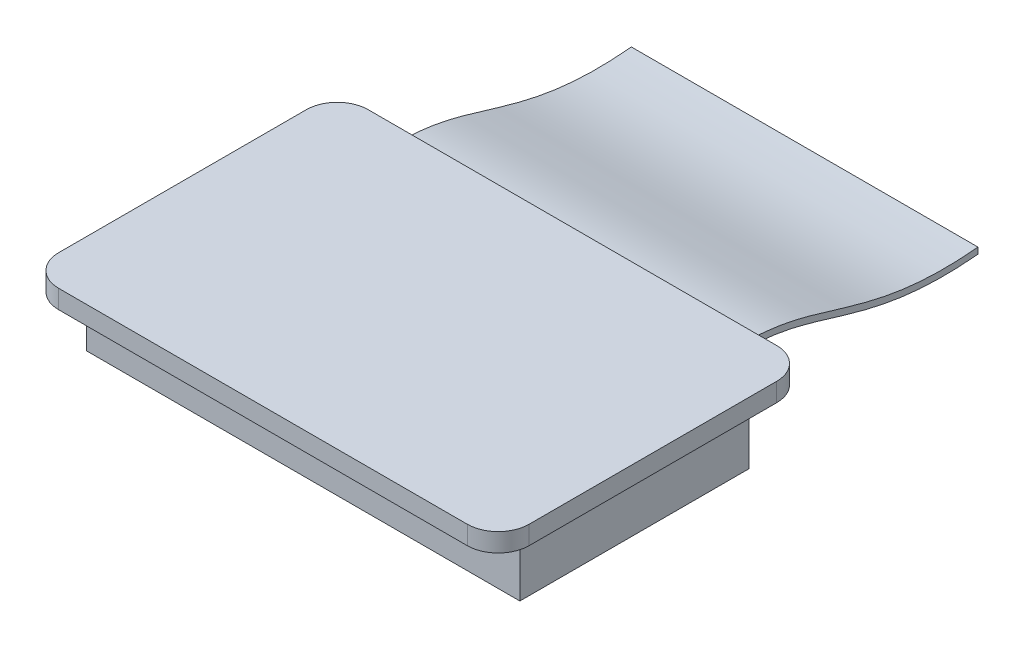
ISO-10303-21;
HEADER;
FILE_DESCRIPTION(('STEP AP214'),'2;1');
FILE_NAME('part.step','',(''),(''),'','','');
FILE_SCHEMA(('AUTOMOTIVE_DESIGN { 1 0 10303 214 1 1 1 1 }'));
ENDSEC;
DATA;
#1=APPLICATION_CONTEXT('core data for automotive mechanical design processes');
#2=APPLICATION_PROTOCOL_DEFINITION('international standard','automotive_design',2000,#1);
#3=PRODUCT_CONTEXT('',#1,'mechanical');
#4=PRODUCT('Part','Part','',(#3));
#5=PRODUCT_RELATED_PRODUCT_CATEGORY('part','',(#4));
#6=PRODUCT_DEFINITION_FORMATION('','',#4);
#7=PRODUCT_DEFINITION_CONTEXT('part definition',#1,'design');
#8=PRODUCT_DEFINITION('design','',#6,#7);
#9=PRODUCT_DEFINITION_SHAPE('','',#8);
#10=(LENGTH_UNIT() NAMED_UNIT(*) SI_UNIT(.MILLI.,.METRE.));
#11=(NAMED_UNIT(*) PLANE_ANGLE_UNIT() SI_UNIT($,.RADIAN.));
#12=(NAMED_UNIT(*) SI_UNIT($,.STERADIAN.) SOLID_ANGLE_UNIT());
#13=UNCERTAINTY_MEASURE_WITH_UNIT(LENGTH_MEASURE(1.E-05),#10,'distance_accuracy_value','');
#14=(GEOMETRIC_REPRESENTATION_CONTEXT(3) GLOBAL_UNCERTAINTY_ASSIGNED_CONTEXT((#13)) GLOBAL_UNIT_ASSIGNED_CONTEXT((#10,
#11,#12)) REPRESENTATION_CONTEXT('',''));
#15=CARTESIAN_POINT('',(0.,0.,0.));
#16=DIRECTION('',(0.,0.,1.));
#17=DIRECTION('',(1.,0.,0.));
#18=AXIS2_PLACEMENT_3D('',#15,#16,#17);
#19=CARTESIAN_POINT('',(3.3,0.748301222298696,8.25169585037883));
#20=DIRECTION('',(0.,-1.,0.));
#21=DIRECTION('',(0.,0.,-1.));
#22=AXIS2_PLACEMENT_3D('',#19,#20,#21);
#23=CYLINDRICAL_SURFACE('',#22,0.5);
#24=CARTESIAN_POINT('',(3.3,0.448301222298696,8.25169585037883));
#25=DIRECTION('',(0.,-1.,0.));
#26=DIRECTION('',(0.,0.,-1.));
#27=AXIS2_PLACEMENT_3D('',#24,#25,#26);
#28=CIRCLE('',#27,0.5);
#29=CARTESIAN_POINT('',(3.3,0.448301222298696,7.75169585037883));
#30=VERTEX_POINT('',#29);
#31=CARTESIAN_POINT('',(3.8,0.448301222298696,8.25169585037883));
#32=VERTEX_POINT('',#31);
#33=EDGE_CURVE('E190',#30,#32,#28,.T.);
#34=ORIENTED_EDGE('',*,*,#33,.F.);
#35=DIRECTION('',(0.,-1.,0.));
#36=VECTOR('',#35,1.);
#37=CARTESIAN_POINT('',(3.3,0.748301222298696,7.75169585037883));
#38=LINE('',#37,#36);
#39=CARTESIAN_POINT('',(3.3,0.748301222298696,7.75169585037883));
#40=VERTEX_POINT('',#39);
#41=EDGE_CURVE('E13',#40,#30,#38,.T.);
#42=ORIENTED_EDGE('',*,*,#41,.F.);
#43=CARTESIAN_POINT('',(3.3,0.748301222298696,8.25169585037883));
#44=DIRECTION('',(0.,-1.,0.));
#45=DIRECTION('',(0.,0.,-1.));
#46=AXIS2_PLACEMENT_3D('',#43,#44,#45);
#47=CIRCLE('',#46,0.5);
#48=CARTESIAN_POINT('',(3.8,0.748301222298696,8.25169585037883));
#49=VERTEX_POINT('',#48);
#50=EDGE_CURVE('E219',#40,#49,#47,.T.);
#51=ORIENTED_EDGE('',*,*,#50,.T.);
#52=DIRECTION('',(0.,-1.,0.));
#53=VECTOR('',#52,1.);
#54=CARTESIAN_POINT('',(3.8,0.748301222298696,8.25169585037883));
#55=LINE('',#54,#53);
#56=EDGE_CURVE('E75',#49,#32,#55,.T.);
#57=ORIENTED_EDGE('',*,*,#56,.T.);
#58=EDGE_LOOP('',(#34,#42,#51,#57));
#59=FACE_BOUND('',#58,.T.);
#60=ADVANCED_FACE('F72',(#59),#23,.T.);
#61=CARTESIAN_POINT('',(-3.3,0.748301222298696,7.75169585037883));
#62=DIRECTION('',(0.,0.,-1.));
#63=DIRECTION('',(-1.,0.,0.));
#64=AXIS2_PLACEMENT_3D('',#61,#62,#63);
#65=PLANE('',#64);
#66=DIRECTION('',(1.,0.,0.));
#67=VECTOR('',#66,1.);
#68=CARTESIAN_POINT('',(-3.3,0.448301222298696,7.75169585037883));
#69=LINE('',#68,#67);
#70=CARTESIAN_POINT('',(-3.3,0.448301222298696,7.75169585037883));
#71=VERTEX_POINT('',#70);
#72=EDGE_CURVE('E216',#71,#30,#69,.T.);
#73=ORIENTED_EDGE('',*,*,#72,.F.);
#74=DIRECTION('',(0.,-1.,0.));
#75=VECTOR('',#74,1.);
#76=CARTESIAN_POINT('',(-3.3,0.748301222298696,7.75169585037883));
#77=LINE('',#76,#75);
#78=CARTESIAN_POINT('',(-3.3,0.748301222298696,7.75169585037883));
#79=VERTEX_POINT('',#78);
#80=EDGE_CURVE('E81',#79,#71,#77,.T.);
#81=ORIENTED_EDGE('',*,*,#80,.F.);
#82=DIRECTION('',(1.,0.,0.));
#83=VECTOR('',#82,1.);
#84=CARTESIAN_POINT('',(-3.3,0.748301222298696,7.75169585037883));
#85=LINE('',#84,#83);
#86=EDGE_CURVE('E174',#79,#40,#85,.T.);
#87=ORIENTED_EDGE('',*,*,#86,.T.);
#88=ORIENTED_EDGE('',*,*,#41,.T.);
#89=EDGE_LOOP('',(#73,#81,#87,#88));
#90=FACE_BOUND('',#89,.T.);
#91=ADVANCED_FACE('F241',(#90),#65,.T.);
#92=CARTESIAN_POINT('',(-3.3,0.748301222298696,8.25169585037883));
#93=DIRECTION('',(0.,-1.,0.));
#94=DIRECTION('',(0.,0.,-1.));
#95=AXIS2_PLACEMENT_3D('',#92,#93,#94);
#96=CYLINDRICAL_SURFACE('',#95,0.5);
#97=CARTESIAN_POINT('',(-3.3,0.448301222298696,8.25169585037883));
#98=DIRECTION('',(0.,-1.,0.));
#99=DIRECTION('',(0.,0.,-1.));
#100=AXIS2_PLACEMENT_3D('',#97,#98,#99);
#101=CIRCLE('',#100,0.5);
#102=CARTESIAN_POINT('',(-3.8,0.448301222298696,8.25169585037883));
#103=VERTEX_POINT('',#102);
#104=EDGE_CURVE('E160',#103,#71,#101,.T.);
#105=ORIENTED_EDGE('',*,*,#104,.F.);
#106=DIRECTION('',(0.,-1.,0.));
#107=VECTOR('',#106,1.);
#108=CARTESIAN_POINT('',(-3.8,0.748301222298696,8.25169585037883));
#109=LINE('',#108,#107);
#110=CARTESIAN_POINT('',(-3.8,0.748301222298696,8.25169585037883));
#111=VERTEX_POINT('',#110);
#112=EDGE_CURVE('E154',#111,#103,#109,.T.);
#113=ORIENTED_EDGE('',*,*,#112,.F.);
#114=CARTESIAN_POINT('',(-3.3,0.748301222298696,8.25169585037883));
#115=DIRECTION('',(0.,-1.,0.));
#116=DIRECTION('',(0.,0.,-1.));
#117=AXIS2_PLACEMENT_3D('',#114,#115,#116);
#118=CIRCLE('',#117,0.5);
#119=EDGE_CURVE('E157',#111,#79,#118,.T.);
#120=ORIENTED_EDGE('',*,*,#119,.T.);
#121=ORIENTED_EDGE('',*,*,#80,.T.);
#122=EDGE_LOOP('',(#105,#113,#120,#121));
#123=FACE_BOUND('',#122,.T.);
#124=ADVANCED_FACE('F156',(#123),#96,.T.);
#125=CARTESIAN_POINT('',(-3.8,0.748301222298696,12.2516958503788));
#126=DIRECTION('',(-1.,0.,0.));
#127=DIRECTION('',(0.,0.,1.));
#128=AXIS2_PLACEMENT_3D('',#125,#126,#127);
#129=PLANE('',#128);
#130=DIRECTION('',(0.,0.,-1.));
#131=VECTOR('',#130,1.);
#132=CARTESIAN_POINT('',(-3.8,0.448301222298696,12.2516958503788));
#133=LINE('',#132,#131);
#134=CARTESIAN_POINT('',(-3.8,0.448301222298696,12.2516958503788));
#135=VERTEX_POINT('',#134);
#136=EDGE_CURVE('E211',#135,#103,#133,.T.);
#137=ORIENTED_EDGE('',*,*,#136,.F.);
#138=DIRECTION('',(0.,-1.,0.));
#139=VECTOR('',#138,1.);
#140=CARTESIAN_POINT('',(-3.8,0.748301222298696,12.2516958503788));
#141=LINE('',#140,#139);
#142=CARTESIAN_POINT('',(-3.8,0.748301222298696,12.2516958503788));
#143=VERTEX_POINT('',#142);
#144=EDGE_CURVE('E166',#143,#135,#141,.T.);
#145=ORIENTED_EDGE('',*,*,#144,.F.);
#146=DIRECTION('',(0.,0.,-1.));
#147=VECTOR('',#146,1.);
#148=CARTESIAN_POINT('',(-3.8,0.748301222298696,12.2516958503788));
#149=LINE('',#148,#147);
#150=EDGE_CURVE('E172',#143,#111,#149,.T.);
#151=ORIENTED_EDGE('',*,*,#150,.T.);
#152=ORIENTED_EDGE('',*,*,#112,.T.);
#153=EDGE_LOOP('',(#137,#145,#151,#152));
#154=FACE_BOUND('',#153,.T.);
#155=ADVANCED_FACE('F177',(#154),#129,.T.);
#156=CARTESIAN_POINT('',(-3.3,0.748301222298696,12.2516958503788));
#157=DIRECTION('',(0.,-1.,0.));
#158=DIRECTION('',(0.,0.,-1.));
#159=AXIS2_PLACEMENT_3D('',#156,#157,#158);
#160=CYLINDRICAL_SURFACE('',#159,0.5);
#161=CARTESIAN_POINT('',(-3.3,0.448301222298696,12.2516958503788));
#162=DIRECTION('',(0.,-1.,0.));
#163=DIRECTION('',(0.,0.,-1.));
#164=AXIS2_PLACEMENT_3D('',#161,#162,#163);
#165=CIRCLE('',#164,0.5);
#166=CARTESIAN_POINT('',(-3.3,0.448301222298696,12.7516958503788));
#167=VERTEX_POINT('',#166);
#168=EDGE_CURVE('E207',#167,#135,#165,.T.);
#169=ORIENTED_EDGE('',*,*,#168,.F.);
#170=DIRECTION('',(0.,-1.,0.));
#171=VECTOR('',#170,1.);
#172=CARTESIAN_POINT('',(-3.3,0.748301222298696,12.7516958503788));
#173=LINE('',#172,#171);
#174=CARTESIAN_POINT('',(-3.3,0.748301222298696,12.7516958503788));
#175=VERTEX_POINT('',#174);
#176=EDGE_CURVE('E225',#175,#167,#173,.T.);
#177=ORIENTED_EDGE('',*,*,#176,.F.);
#178=CARTESIAN_POINT('',(-3.3,0.748301222298696,12.2516958503788));
#179=DIRECTION('',(0.,-1.,0.));
#180=DIRECTION('',(0.,0.,-1.));
#181=AXIS2_PLACEMENT_3D('',#178,#179,#180);
#182=CIRCLE('',#181,0.5);
#183=EDGE_CURVE('E179',#175,#143,#182,.T.);
#184=ORIENTED_EDGE('',*,*,#183,.T.);
#185=ORIENTED_EDGE('',*,*,#144,.T.);
#186=EDGE_LOOP('',(#169,#177,#184,#185));
#187=FACE_BOUND('',#186,.T.);
#188=ADVANCED_FACE('F254',(#187),#160,.T.);
#189=CARTESIAN_POINT('',(-3.3,0.748301222298696,12.7516958503788));
#190=DIRECTION('',(0.,0.,1.));
#191=DIRECTION('',(1.,0.,0.));
#192=AXIS2_PLACEMENT_3D('',#189,#190,#191);
#193=PLANE('',#192);
#194=DIRECTION('',(-1.,0.,0.));
#195=VECTOR('',#194,1.);
#196=CARTESIAN_POINT('',(-3.3,0.448301222298696,12.7516958503788));
#197=LINE('',#196,#195);
#198=CARTESIAN_POINT('',(3.3,0.448301222298696,12.7516958503788));
#199=VERTEX_POINT('',#198);
#200=EDGE_CURVE('E203',#199,#167,#197,.T.);
#201=ORIENTED_EDGE('',*,*,#200,.F.);
#202=DIRECTION('',(0.,-1.,0.));
#203=VECTOR('',#202,1.);
#204=CARTESIAN_POINT('',(3.3,0.748301222298696,12.7516958503788));
#205=LINE('',#204,#203);
#206=CARTESIAN_POINT('',(3.3,0.748301222298696,12.7516958503788));
#207=VERTEX_POINT('',#206);
#208=EDGE_CURVE('E228',#207,#199,#205,.T.);
#209=ORIENTED_EDGE('',*,*,#208,.F.);
#210=DIRECTION('',(-1.,0.,0.));
#211=VECTOR('',#210,1.);
#212=CARTESIAN_POINT('',(-3.3,0.748301222298696,12.7516958503788));
#213=LINE('',#212,#211);
#214=EDGE_CURVE('E184',#207,#175,#213,.T.);
#215=ORIENTED_EDGE('',*,*,#214,.T.);
#216=ORIENTED_EDGE('',*,*,#176,.T.);
#217=EDGE_LOOP('',(#201,#209,#215,#216));
#218=FACE_BOUND('',#217,.T.);
#219=ADVANCED_FACE('F257',(#218),#193,.T.);
#220=CARTESIAN_POINT('',(3.3,0.748301222298696,12.2516958503788));
#221=DIRECTION('',(0.,-1.,0.));
#222=DIRECTION('',(0.,0.,-1.));
#223=AXIS2_PLACEMENT_3D('',#220,#221,#222);
#224=CYLINDRICAL_SURFACE('',#223,0.5);
#225=CARTESIAN_POINT('',(3.3,0.448301222298696,12.2516958503788));
#226=DIRECTION('',(0.,-1.,0.));
#227=DIRECTION('',(0.,0.,1.));
#228=AXIS2_PLACEMENT_3D('',#225,#226,#227);
#229=CIRCLE('',#228,0.5);
#230=CARTESIAN_POINT('',(3.8,0.448301222298696,12.2516958503788));
#231=VERTEX_POINT('',#230);
#232=EDGE_CURVE('E199',#231,#199,#229,.T.);
#233=ORIENTED_EDGE('',*,*,#232,.F.);
#234=DIRECTION('',(0.,-1.,0.));
#235=VECTOR('',#234,1.);
#236=CARTESIAN_POINT('',(3.8,0.748301222298696,12.2516958503788));
#237=LINE('',#236,#235);
#238=CARTESIAN_POINT('',(3.8,0.748301222298696,12.2516958503788));
#239=VERTEX_POINT('',#238);
#240=EDGE_CURVE('E230',#239,#231,#237,.T.);
#241=ORIENTED_EDGE('',*,*,#240,.F.);
#242=CARTESIAN_POINT('',(3.3,0.748301222298696,12.2516958503788));
#243=DIRECTION('',(0.,-1.,0.));
#244=DIRECTION('',(0.,0.,1.));
#245=AXIS2_PLACEMENT_3D('',#242,#243,#244);
#246=CIRCLE('',#245,0.5);
#247=EDGE_CURVE('E332',#239,#207,#246,.T.);
#248=ORIENTED_EDGE('',*,*,#247,.T.);
#249=ORIENTED_EDGE('',*,*,#208,.T.);
#250=EDGE_LOOP('',(#233,#241,#248,#249));
#251=FACE_BOUND('',#250,.T.);
#252=ADVANCED_FACE('F261',(#251),#224,.T.);
#253=CARTESIAN_POINT('',(3.8,0.748301222298696,12.2516958503788));
#254=DIRECTION('',(1.,0.,0.));
#255=DIRECTION('',(0.,0.,-1.));
#256=AXIS2_PLACEMENT_3D('',#253,#254,#255);
#257=PLANE('',#256);
#258=DIRECTION('',(0.,0.,1.));
#259=VECTOR('',#258,1.);
#260=CARTESIAN_POINT('',(3.8,0.448301222298696,12.2516958503788));
#261=LINE('',#260,#259);
#262=EDGE_CURVE('E194',#32,#231,#261,.T.);
#263=ORIENTED_EDGE('',*,*,#262,.F.);
#264=ORIENTED_EDGE('',*,*,#56,.F.);
#265=DIRECTION('',(0.,0.,1.));
#266=VECTOR('',#265,1.);
#267=CARTESIAN_POINT('',(3.8,0.748301222298696,12.2516958503788));
#268=LINE('',#267,#266);
#269=EDGE_CURVE('E329',#49,#239,#268,.T.);
#270=ORIENTED_EDGE('',*,*,#269,.T.);
#271=ORIENTED_EDGE('',*,*,#240,.T.);
#272=EDGE_LOOP('',(#263,#264,#270,#271));
#273=FACE_BOUND('',#272,.T.);
#274=ADVANCED_FACE('F238',(#273),#257,.T.);
#275=CARTESIAN_POINT('',(3.3,0.748301222298696,8.25169585037883));
#276=DIRECTION('',(0.,-1.,0.));
#277=DIRECTION('',(0.,0.,-1.));
#278=AXIS2_PLACEMENT_3D('',#275,#276,#277);
#279=PLANE('',#278);
#280=ORIENTED_EDGE('',*,*,#50,.F.);
#281=ORIENTED_EDGE('',*,*,#86,.F.);
#282=ORIENTED_EDGE('',*,*,#119,.F.);
#283=ORIENTED_EDGE('',*,*,#150,.F.);
#284=ORIENTED_EDGE('',*,*,#183,.F.);
#285=ORIENTED_EDGE('',*,*,#214,.F.);
#286=ORIENTED_EDGE('',*,*,#247,.F.);
#287=ORIENTED_EDGE('',*,*,#269,.F.);
#288=EDGE_LOOP('',(#280,#281,#282,#283,#284,#285,#286,#287));
#289=FACE_BOUND('',#288,.T.);
#290=ADVANCED_FACE('F170',(#289),#279,.F.);
#291=CARTESIAN_POINT('',(3.3,0.448301222298696,8.25169585037883));
#292=DIRECTION('',(0.,-1.,0.));
#293=DIRECTION('',(0.,0.,-1.));
#294=AXIS2_PLACEMENT_3D('',#291,#292,#293);
#295=PLANE('',#294);
#296=DIRECTION('',(0.,0.,1.));
#297=VECTOR('',#296,1.);
#298=CARTESIAN_POINT('',(3.5,0.448301222298696,12.1016958503788));
#299=LINE('',#298,#297);
#300=CARTESIAN_POINT('',(3.5,0.448301222298696,8.40169585037883));
#301=VERTEX_POINT('',#300);
#302=CARTESIAN_POINT('',(3.5,0.448301222298696,12.1016958503788));
#303=VERTEX_POINT('',#302);
#304=EDGE_CURVE('E307',#301,#303,#299,.T.);
#305=ORIENTED_EDGE('',*,*,#304,.F.);
#306=DIRECTION('',(-1.,0.,0.));
#307=VECTOR('',#306,1.);
#308=CARTESIAN_POINT('',(3.5,0.448301222298696,8.40169585037883));
#309=LINE('',#308,#307);
#310=CARTESIAN_POINT('',(-3.5,0.448301222298696,8.40169585037883));
#311=VERTEX_POINT('',#310);
#312=EDGE_CURVE('E323',#301,#311,#309,.T.);
#313=ORIENTED_EDGE('',*,*,#312,.T.);
#314=DIRECTION('',(0.,0.,1.));
#315=VECTOR('',#314,1.);
#316=CARTESIAN_POINT('',(-3.5,0.448301222298696,12.1016958503788));
#317=LINE('',#316,#315);
#318=CARTESIAN_POINT('',(-3.5,0.448301222298696,12.1016958503788));
#319=VERTEX_POINT('',#318);
#320=EDGE_CURVE('E311',#311,#319,#317,.T.);
#321=ORIENTED_EDGE('',*,*,#320,.T.);
#322=DIRECTION('',(-1.,0.,0.));
#323=VECTOR('',#322,1.);
#324=CARTESIAN_POINT('',(3.5,0.448301222298696,12.1016958503788));
#325=LINE('',#324,#323);
#326=EDGE_CURVE('E373',#303,#319,#325,.T.);
#327=ORIENTED_EDGE('',*,*,#326,.F.);
#328=EDGE_LOOP('',(#305,#313,#321,#327));
#329=FACE_BOUND('',#328,.T.);
#330=ORIENTED_EDGE('',*,*,#33,.T.);
#331=ORIENTED_EDGE('',*,*,#262,.T.);
#332=ORIENTED_EDGE('',*,*,#232,.T.);
#333=ORIENTED_EDGE('',*,*,#200,.T.);
#334=ORIENTED_EDGE('',*,*,#168,.T.);
#335=ORIENTED_EDGE('',*,*,#136,.T.);
#336=ORIENTED_EDGE('',*,*,#104,.T.);
#337=ORIENTED_EDGE('',*,*,#72,.T.);
#338=EDGE_LOOP('',(#330,#331,#332,#333,#334,#335,#336,#337));
#339=FACE_BOUND('',#338,.T.);
#340=ADVANCED_FACE('F240',(#329,#339),#295,.T.);
#341=CARTESIAN_POINT('',(3.5,0.448301222298696,12.1016958503788));
#342=DIRECTION('',(0.,0.,-1.));
#343=DIRECTION('',(-1.,0.,0.));
#344=AXIS2_PLACEMENT_3D('',#341,#342,#343);
#345=PLANE('',#344);
#346=DIRECTION('',(0.,-1.,0.));
#347=VECTOR('',#346,1.);
#348=CARTESIAN_POINT('',(-3.5,0.448301222298696,12.1016958503788));
#349=LINE('',#348,#347);
#350=CARTESIAN_POINT('',(-3.5,-0.551698777701304,12.1016958503788));
#351=VERTEX_POINT('',#350);
#352=EDGE_CURVE('E89',#319,#351,#349,.T.);
#353=ORIENTED_EDGE('',*,*,#352,.T.);
#354=DIRECTION('',(-1.,0.,0.));
#355=VECTOR('',#354,1.);
#356=CARTESIAN_POINT('',(3.5,-0.551698777701304,12.1016958503788));
#357=LINE('',#356,#355);
#358=CARTESIAN_POINT('',(3.5,-0.551698777701304,12.1016958503788));
#359=VERTEX_POINT('',#358);
#360=EDGE_CURVE('E195',#359,#351,#357,.T.);
#361=ORIENTED_EDGE('',*,*,#360,.F.);
#362=DIRECTION('',(0.,-1.,0.));
#363=VECTOR('',#362,1.);
#364=CARTESIAN_POINT('',(3.5,0.448301222298696,12.1016958503788));
#365=LINE('',#364,#363);
#366=EDGE_CURVE('E299',#303,#359,#365,.T.);
#367=ORIENTED_EDGE('',*,*,#366,.F.);
#368=ORIENTED_EDGE('',*,*,#326,.T.);
#369=EDGE_LOOP('',(#353,#361,#367,#368));
#370=FACE_BOUND('',#369,.T.);
#371=ADVANCED_FACE('F272',(#370),#345,.F.);
#372=CARTESIAN_POINT('',(3.5,-0.551698777701304,12.1016958503788));
#373=DIRECTION('',(0.,1.,0.));
#374=DIRECTION('',(0.,0.,1.));
#375=AXIS2_PLACEMENT_3D('',#372,#373,#374);
#376=PLANE('',#375);
#377=DIRECTION('',(0.,0.,-1.));
#378=VECTOR('',#377,1.);
#379=CARTESIAN_POINT('',(-3.5,-0.551698777701304,12.1016958503788));
#380=LINE('',#379,#378);
#381=CARTESIAN_POINT('',(-3.5,-0.551698777701304,8.40169585037883));
#382=VERTEX_POINT('',#381);
#383=EDGE_CURVE('E403',#351,#382,#380,.T.);
#384=ORIENTED_EDGE('',*,*,#383,.T.);
#385=DIRECTION('',(-1.,0.,0.));
#386=VECTOR('',#385,1.);
#387=CARTESIAN_POINT('',(3.5,-0.551698777701304,8.40169585037883));
#388=LINE('',#387,#386);
#389=CARTESIAN_POINT('',(3.5,-0.551698777701304,8.40169585037883));
#390=VERTEX_POINT('',#389);
#391=EDGE_CURVE('E317',#390,#382,#388,.T.);
#392=ORIENTED_EDGE('',*,*,#391,.F.);
#393=DIRECTION('',(0.,0.,-1.));
#394=VECTOR('',#393,1.);
#395=CARTESIAN_POINT('',(3.5,-0.551698777701304,12.1016958503788));
#396=LINE('',#395,#394);
#397=EDGE_CURVE('E304',#359,#390,#396,.T.);
#398=ORIENTED_EDGE('',*,*,#397,.F.);
#399=ORIENTED_EDGE('',*,*,#360,.T.);
#400=EDGE_LOOP('',(#384,#392,#398,#399));
#401=FACE_BOUND('',#400,.T.);
#402=ADVANCED_FACE('F277',(#401),#376,.F.);
#403=CARTESIAN_POINT('',(3.5,0.448301222298696,8.40169585037883));
#404=DIRECTION('',(0.,0.,1.));
#405=DIRECTION('',(1.,0.,0.));
#406=AXIS2_PLACEMENT_3D('',#403,#404,#405);
#407=PLANE('',#406);
#408=DIRECTION('',(0.,1.,0.));
#409=VECTOR('',#408,1.);
#410=CARTESIAN_POINT('',(-3.5,0.448301222298696,8.40169585037883));
#411=LINE('',#410,#409);
#412=EDGE_CURVE('E397',#382,#311,#411,.T.);
#413=ORIENTED_EDGE('',*,*,#412,.T.);
#414=ORIENTED_EDGE('',*,*,#312,.F.);
#415=DIRECTION('',(0.,1.,0.));
#416=VECTOR('',#415,1.);
#417=CARTESIAN_POINT('',(3.5,0.448301222298696,8.40169585037883));
#418=LINE('',#417,#416);
#419=EDGE_CURVE('E381',#390,#301,#418,.T.);
#420=ORIENTED_EDGE('',*,*,#419,.F.);
#421=ORIENTED_EDGE('',*,*,#391,.T.);
#422=EDGE_LOOP('',(#413,#414,#420,#421));
#423=FACE_BOUND('',#422,.T.);
#424=ADVANCED_FACE('F281',(#423),#407,.F.);
#425=CARTESIAN_POINT('',(3.5,0.,0.));
#426=DIRECTION('',(1.,0.,0.));
#427=DIRECTION('',(0.,0.,-1.));
#428=AXIS2_PLACEMENT_3D('',#425,#426,#427);
#429=PLANE('',#428);
#430=ORIENTED_EDGE('',*,*,#366,.T.);
#431=ORIENTED_EDGE('',*,*,#397,.T.);
#432=ORIENTED_EDGE('',*,*,#419,.T.);
#433=ORIENTED_EDGE('',*,*,#304,.T.);
#434=EDGE_LOOP('',(#430,#431,#432,#433));
#435=FACE_BOUND('',#434,.T.);
#436=ADVANCED_FACE('F285',(#435),#429,.T.);
#437=CARTESIAN_POINT('',(-3.5,0.,0.));
#438=DIRECTION('',(1.,0.,0.));
#439=DIRECTION('',(0.,0.,-1.));
#440=AXIS2_PLACEMENT_3D('',#437,#438,#439);
#441=PLANE('',#440);
#442=ORIENTED_EDGE('',*,*,#352,.F.);
#443=ORIENTED_EDGE('',*,*,#320,.F.);
#444=ORIENTED_EDGE('',*,*,#412,.F.);
#445=ORIENTED_EDGE('',*,*,#383,.F.);
#446=EDGE_LOOP('',(#442,#443,#444,#445));
#447=FACE_BOUND('',#446,.T.);
#448=ADVANCED_FACE('F287',(#447),#441,.F.);
#449=CLOSED_SHELL('',(#60,#91,#124,#155,#188,#219,#252,#274,#290,#340,#371,#402,#424,#436,#448));
#450=MANIFOLD_SOLID_BREP('B2',#449);
#451=CARTESIAN_POINT('',(0.,0.547843022465262,7.74213394577779));
#452=DIRECTION('',(0.,0.0956190460103406,0.995418001665668));
#453=DIRECTION('',(1.,0.,0.));
#454=AXIS2_PLACEMENT_3D('',#451,#452,#453);
#455=PLANE('',#454);
#456=DIRECTION('',(0.,-0.995418001665668,0.0956190460103406));
#457=VECTOR('',#456,1.);
#458=CARTESIAN_POINT('',(-2.8,0.547843022465262,7.74213394577779));
#459=LINE('',#458,#457);
#460=CARTESIAN_POINT('',(-2.8,0.547843022465262,7.74213394577779));
#461=VERTEX_POINT('',#460);
#462=CARTESIAN_POINT('',(-2.8,0.448301222298696,7.75169585037883));
#463=VERTEX_POINT('',#462);
#464=EDGE_CURVE('E614',#461,#463,#459,.T.);
#465=ORIENTED_EDGE('',*,*,#464,.T.);
#466=DIRECTION('',(1.,0.,0.));
#467=VECTOR('',#466,1.);
#468=CARTESIAN_POINT('',(-2.8,0.448301222298696,7.75169585037883));
#469=LINE('',#468,#467);
#470=CARTESIAN_POINT('',(2.8,0.448301222298696,7.75169585037883));
#471=VERTEX_POINT('',#470);
#472=EDGE_CURVE('E622',#463,#471,#469,.T.);
#473=ORIENTED_EDGE('',*,*,#472,.T.);
#474=DIRECTION('',(0.,0.995418001665668,-0.0956190460103406));
#475=VECTOR('',#474,1.);
#476=CARTESIAN_POINT('',(2.8,0.547843022465263,7.74213394577779));
#477=LINE('',#476,#475);
#478=CARTESIAN_POINT('',(2.8,0.547843022465263,7.74213394577779));
#479=VERTEX_POINT('',#478);
#480=EDGE_CURVE('E615',#471,#479,#477,.T.);
#481=ORIENTED_EDGE('',*,*,#480,.T.);
#482=DIRECTION('',(-1.,0.,0.));
#483=VECTOR('',#482,1.);
#484=CARTESIAN_POINT('',(-2.8,0.547843022465262,7.74213394577779));
#485=LINE('',#484,#483);
#486=EDGE_CURVE('E574',#479,#461,#485,.T.);
#487=ORIENTED_EDGE('',*,*,#486,.T.);
#488=EDGE_LOOP('',(#465,#473,#481,#487));
#489=FACE_BOUND('',#488,.T.);
#490=ADVANCED_FACE('F570',(#489),#455,.T.);
#491=CARTESIAN_POINT('',(0.,0.,3.99999999999998));
#492=DIRECTION('',(0.,0.,1.));
#493=DIRECTION('',(1.,0.,0.));
#494=AXIS2_PLACEMENT_3D('',#491,#492,#493);
#495=PLANE('',#494);
#496=DIRECTION('',(0.,-1.,0.));
#497=VECTOR('',#496,1.);
#498=CARTESIAN_POINT('',(-2.8,0.,3.99999999999998));
#499=LINE('',#498,#497);
#500=CARTESIAN_POINT('',(-2.8,0.,3.99999999999998));
#501=VERTEX_POINT('',#500);
#502=CARTESIAN_POINT('',(-2.8,-0.0999999999999998,3.99999999999998));
#503=VERTEX_POINT('',#502);
#504=EDGE_CURVE('E627',#501,#503,#499,.T.);
#505=ORIENTED_EDGE('',*,*,#504,.F.);
#506=DIRECTION('',(-1.,0.,0.));
#507=VECTOR('',#506,1.);
#508=CARTESIAN_POINT('',(-2.8,0.,3.99999999999998));
#509=LINE('',#508,#507);
#510=CARTESIAN_POINT('',(2.8,0.,3.99999999999998));
#511=VERTEX_POINT('',#510);
#512=EDGE_CURVE('E70',#511,#501,#509,.T.);
#513=ORIENTED_EDGE('',*,*,#512,.F.);
#514=DIRECTION('',(0.,1.,0.));
#515=VECTOR('',#514,1.);
#516=CARTESIAN_POINT('',(2.8,0.,3.99999999999998));
#517=LINE('',#516,#515);
#518=CARTESIAN_POINT('',(2.8,-0.0999999999999998,3.99999999999998));
#519=VERTEX_POINT('',#518);
#520=EDGE_CURVE('E581',#519,#511,#517,.T.);
#521=ORIENTED_EDGE('',*,*,#520,.F.);
#522=DIRECTION('',(1.,0.,0.));
#523=VECTOR('',#522,1.);
#524=CARTESIAN_POINT('',(-2.8,-0.0999999999999998,3.99999999999998));
#525=LINE('',#524,#523);
#526=EDGE_CURVE('E633',#503,#519,#525,.T.);
#527=ORIENTED_EDGE('',*,*,#526,.F.);
#528=EDGE_LOOP('',(#505,#513,#521,#527));
#529=FACE_BOUND('',#528,.T.);
#530=ADVANCED_FACE('F719',(#529),#495,.F.);
#531=CARTESIAN_POINT('',(2.8,0.,3.99999999999998));
#532=CARTESIAN_POINT('',(2.8,-0.024628468128532,4.25638846601688));
#533=CARTESIAN_POINT('',(2.8,-0.0386180157529813,4.72259081002346));
#534=CARTESIAN_POINT('',(2.8,0.0194715301087126,5.3120111853385));
#535=CARTESIAN_POINT('',(2.8,0.129906644668738,5.82138904334296));
#536=CARTESIAN_POINT('',(2.8,0.291873769263778,6.3680270958267));
#537=CARTESIAN_POINT('',(2.8,0.477782991355757,6.96597559310496));
#538=CARTESIAN_POINT('',(2.8,0.547843022465264,7.46326880544397));
#539=CARTESIAN_POINT('',(2.8,0.547843022465264,7.74213394577779));
#540=CARTESIAN_POINT('',(-2.8,0.,3.99999999999998));
#541=CARTESIAN_POINT('',(-2.8,-0.0246284681285331,4.25638846601688));
#542=CARTESIAN_POINT('',(-2.8,-0.0386180157529824,4.72259081002346));
#543=CARTESIAN_POINT('',(-2.8,0.0194715301087115,5.3120111853385));
#544=CARTESIAN_POINT('',(-2.8,0.129906644668737,5.82138904334296));
#545=CARTESIAN_POINT('',(-2.8,0.291873769263777,6.3680270958267));
#546=CARTESIAN_POINT('',(-2.8,0.477782991355756,6.96597559310497));
#547=CARTESIAN_POINT('',(-2.8,0.547843022465263,7.46326880544397));
#548=CARTESIAN_POINT('',(-2.8,0.547843022465263,7.74213394577779));
#549=B_SPLINE_SURFACE_WITH_KNOTS('',1,3,((#531,#532,#533,#534,#535,#536,#537,#538,#539),(#540,
#541,#542,#543,#544,#545,#546,#547,#548)),.UNSPECIFIED.,.F.,.F.,.F.,(2,2),(4,1,1,1,1,1,4),
(0.508771929824561,1.),(0.,0.14,0.28,0.42,0.559999999997895,0.780000000000162,1.),.UNSPECIFIED.);
#550=CARTESIAN_POINT('',(-2.8,0.,3.99999999999998));
#551=CARTESIAN_POINT('',(-2.8,-0.0246284681285331,4.25638846601688));
#552=CARTESIAN_POINT('',(-2.8,-0.0386180157529824,4.72259081002346));
#553=CARTESIAN_POINT('',(-2.8,0.0194715301087115,5.3120111853385));
#554=CARTESIAN_POINT('',(-2.8,0.129906644668737,5.82138904334296));
#555=CARTESIAN_POINT('',(-2.8,0.291873769263777,6.3680270958267));
#556=CARTESIAN_POINT('',(-2.8,0.477782991355756,6.96597559310497));
#557=CARTESIAN_POINT('',(-2.8,0.547843022465263,7.46326880544397));
#558=CARTESIAN_POINT('',(-2.8,0.547843022465263,7.74213394577779));
#559=B_SPLINE_CURVE_WITH_KNOTS('',3,(#550,#551,#552,#553,#554,#555,#556,#557,#558),
.UNSPECIFIED.,.F.,.F.,(4,1,1,1,1,1,4),(0.,0.14,0.28,0.42,0.559999999997895,0.780000000000162,
1.),.UNSPECIFIED.);
#560=EDGE_CURVE('E590',#501,#461,#559,.T.);
#561=CARTESIAN_POINT('',(2.8,0.,3.99999999999998));
#562=CARTESIAN_POINT('',(2.8,-0.024628468128532,4.25638846601688));
#563=CARTESIAN_POINT('',(2.8,-0.0386180157529813,4.72259081002346));
#564=CARTESIAN_POINT('',(2.8,0.0194715301087126,5.3120111853385));
#565=CARTESIAN_POINT('',(2.8,0.129906644668738,5.82138904334296));
#566=CARTESIAN_POINT('',(2.8,0.291873769263778,6.3680270958267));
#567=CARTESIAN_POINT('',(2.8,0.477782991355757,6.96597559310496));
#568=CARTESIAN_POINT('',(2.8,0.547843022465264,7.46326880544397));
#569=CARTESIAN_POINT('',(2.8,0.547843022465264,7.74213394577779));
#570=B_SPLINE_CURVE_WITH_KNOTS('',3,(#561,#562,#563,#564,#565,#566,#567,#568,#569),
.UNSPECIFIED.,.F.,.F.,(4,1,1,1,1,1,4),(0.,0.14,0.28,0.42,0.559999999997895,0.780000000000162,
1.),.UNSPECIFIED.);
#571=EDGE_CURVE('E607',#511,#479,#570,.T.);
#572=ORIENTED_EDGE('',*,*,#512,.T.);
#573=ORIENTED_EDGE('',*,*,#560,.T.);
#574=ORIENTED_EDGE('',*,*,#486,.F.);
#575=ORIENTED_EDGE('',*,*,#571,.F.);
#576=EDGE_LOOP('',(#572,#573,#574,#575));
#577=FACE_BOUND('',#576,.T.);
#578=ADVANCED_FACE('F624',(#577),#549,.T.);
#579=CARTESIAN_POINT('',(2.8,-0.0999999999999998,3.99999999999998));
#580=DIRECTION('',(1.,0.,0.));
#581=DIRECTION('',(0.,1.,0.));
#582=AXIS2_PLACEMENT_3D('',#579,#580,#581);
#583=PLANE('',#582);
#584=ORIENTED_EDGE('',*,*,#520,.T.);
#585=ORIENTED_EDGE('',*,*,#571,.T.);
#586=ORIENTED_EDGE('',*,*,#480,.F.);
#587=CARTESIAN_POINT('',(2.8,-0.0999999999999998,3.99999999999998));
#588=CARTESIAN_POINT('',(2.8,-0.124487822602086,4.2605128606233));
#589=CARTESIAN_POINT('',(2.8,-0.13819607917364,4.73496399384273));
#590=CARTESIAN_POINT('',(2.8,-0.0775684463145837,5.33705516657012));
#591=CARTESIAN_POINT('',(2.8,0.0359942616894103,5.85609097163903));
#592=CARTESIAN_POINT('',(2.8,0.200282397231649,6.40790162664091));
#593=CARTESIAN_POINT('',(2.8,0.38279321622902,6.99976726735009));
#594=CARTESIAN_POINT('',(2.8,0.449818563978634,7.48090729992634));
#595=CARTESIAN_POINT('',(2.8,0.448301222298696,7.75169585037883));
#596=B_SPLINE_CURVE_WITH_KNOTS('',3,(#587,#588,#589,#590,#591,#592,#593,#594,#595),
.UNSPECIFIED.,.F.,.F.,(4,1,1,1,1,1,4),(0.,0.14,0.28,0.42,0.559999999997895,0.780000000000162,
1.),.UNSPECIFIED.);
#597=EDGE_CURVE('E635',#519,#471,#596,.T.);
#598=ORIENTED_EDGE('',*,*,#597,.F.);
#599=EDGE_LOOP('',(#584,#585,#586,#598));
#600=FACE_BOUND('',#599,.T.);
#601=ADVANCED_FACE('F704',(#600),#583,.T.);
#602=CARTESIAN_POINT('',(-2.8,-0.0999999999999998,3.99999999999998));
#603=CARTESIAN_POINT('',(-2.8,-0.124487822602086,4.2605128606233));
#604=CARTESIAN_POINT('',(-2.8,-0.13819607917364,4.73496399384273));
#605=CARTESIAN_POINT('',(-2.8,-0.0775684463145837,5.33705516657012));
#606=CARTESIAN_POINT('',(-2.8,0.0359942616894103,5.85609097163903));
#607=CARTESIAN_POINT('',(-2.8,0.200282397231649,6.40790162664091));
#608=CARTESIAN_POINT('',(-2.8,0.38279321622902,6.99976726735009));
#609=CARTESIAN_POINT('',(-2.8,0.449818563978634,7.48090729992634));
#610=CARTESIAN_POINT('',(-2.8,0.448301222298696,7.75169585037883));
#611=CARTESIAN_POINT('',(2.8,-0.0999999999999998,3.99999999999998));
#612=CARTESIAN_POINT('',(2.8,-0.124487822602086,4.2605128606233));
#613=CARTESIAN_POINT('',(2.8,-0.13819607917364,4.73496399384273));
#614=CARTESIAN_POINT('',(2.8,-0.0775684463145837,5.33705516657012));
#615=CARTESIAN_POINT('',(2.8,0.0359942616894103,5.85609097163903));
#616=CARTESIAN_POINT('',(2.8,0.200282397231649,6.40790162664091));
#617=CARTESIAN_POINT('',(2.8,0.38279321622902,6.99976726735009));
#618=CARTESIAN_POINT('',(2.8,0.449818563978634,7.48090729992634));
#619=CARTESIAN_POINT('',(2.8,0.448301222298696,7.75169585037883));
#620=B_SPLINE_SURFACE_WITH_KNOTS('',1,3,((#602,#603,#604,#605,#606,#607,#608,#609,#610),(#611,
#612,#613,#614,#615,#616,#617,#618,#619)),.UNSPECIFIED.,.F.,.F.,.F.,(2,2),(4,1,1,1,1,1,4),
(0.00877192982456138,0.5),(0.,0.14,0.28,0.42,0.559999999997895,0.780000000000162,1.),.UNSPECIFIED.);
#621=CARTESIAN_POINT('',(-2.8,-0.0999999999999998,3.99999999999998));
#622=CARTESIAN_POINT('',(-2.8,-0.124487822602086,4.2605128606233));
#623=CARTESIAN_POINT('',(-2.8,-0.13819607917364,4.73496399384273));
#624=CARTESIAN_POINT('',(-2.8,-0.0775684463145837,5.33705516657012));
#625=CARTESIAN_POINT('',(-2.8,0.0359942616894103,5.85609097163903));
#626=CARTESIAN_POINT('',(-2.8,0.200282397231649,6.40790162664091));
#627=CARTESIAN_POINT('',(-2.8,0.38279321622902,6.99976726735009));
#628=CARTESIAN_POINT('',(-2.8,0.449818563978634,7.48090729992634));
#629=CARTESIAN_POINT('',(-2.8,0.448301222298696,7.75169585037883));
#630=B_SPLINE_CURVE_WITH_KNOTS('',3,(#621,#622,#623,#624,#625,#626,#627,#628,#629),
.UNSPECIFIED.,.F.,.F.,(4,1,1,1,1,1,4),(0.,0.14,0.28,0.42,0.559999999997895,0.780000000000162,
1.),.UNSPECIFIED.);
#631=EDGE_CURVE('E618',#503,#463,#630,.T.);
#632=ORIENTED_EDGE('',*,*,#526,.T.);
#633=ORIENTED_EDGE('',*,*,#597,.T.);
#634=ORIENTED_EDGE('',*,*,#472,.F.);
#635=ORIENTED_EDGE('',*,*,#631,.F.);
#636=EDGE_LOOP('',(#632,#633,#634,#635));
#637=FACE_BOUND('',#636,.T.);
#638=ADVANCED_FACE('F697',(#637),#620,.T.);
#639=CARTESIAN_POINT('',(-2.8,0.,3.99999999999998));
#640=DIRECTION('',(-1.,0.,0.));
#641=DIRECTION('',(0.,-1.,0.));
#642=AXIS2_PLACEMENT_3D('',#639,#640,#641);
#643=PLANE('',#642);
#644=ORIENTED_EDGE('',*,*,#504,.T.);
#645=ORIENTED_EDGE('',*,*,#631,.T.);
#646=ORIENTED_EDGE('',*,*,#464,.F.);
#647=ORIENTED_EDGE('',*,*,#560,.F.);
#648=EDGE_LOOP('',(#644,#645,#646,#647));
#649=FACE_BOUND('',#648,.T.);
#650=ADVANCED_FACE('F572',(#649),#643,.T.);
#651=CLOSED_SHELL('',(#490,#530,#578,#601,#638,#650));
#652=MANIFOLD_SOLID_BREP('B7',#651);
#653=ADVANCED_BREP_SHAPE_REPRESENTATION('',(#18,#450,#652),#14);
#654=SHAPE_DEFINITION_REPRESENTATION(#9,#653);
ENDSEC;
END-ISO-10303-21;
